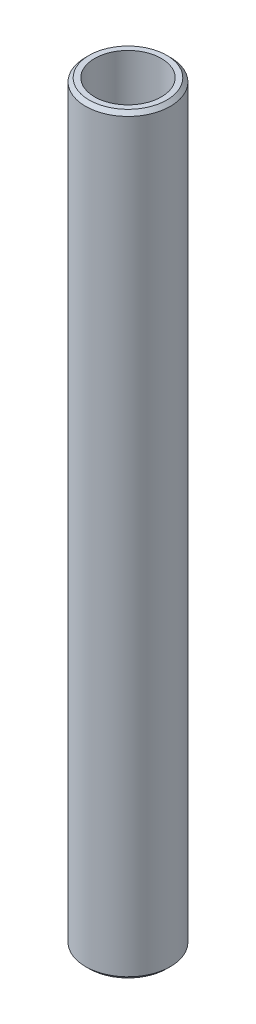
ISO-10303-21;
HEADER;
FILE_DESCRIPTION(('STEP AP214'),'2;1');
FILE_NAME('part.step','',(''),(''),'','','');
FILE_SCHEMA(('AUTOMOTIVE_DESIGN { 1 0 10303 214 1 1 1 1 }'));
ENDSEC;
DATA;
#1=APPLICATION_CONTEXT('core data for automotive mechanical design processes');
#2=APPLICATION_PROTOCOL_DEFINITION('international standard','automotive_design',2000,#1);
#3=PRODUCT_CONTEXT('',#1,'mechanical');
#4=PRODUCT('Part','Part','',(#3));
#5=PRODUCT_RELATED_PRODUCT_CATEGORY('part','',(#4));
#6=PRODUCT_DEFINITION_FORMATION('','',#4);
#7=PRODUCT_DEFINITION_CONTEXT('part definition',#1,'design');
#8=PRODUCT_DEFINITION('design','',#6,#7);
#9=PRODUCT_DEFINITION_SHAPE('','',#8);
#10=(LENGTH_UNIT() NAMED_UNIT(*) SI_UNIT(.MILLI.,.METRE.));
#11=(NAMED_UNIT(*) PLANE_ANGLE_UNIT() SI_UNIT($,.RADIAN.));
#12=(NAMED_UNIT(*) SI_UNIT($,.STERADIAN.) SOLID_ANGLE_UNIT());
#13=UNCERTAINTY_MEASURE_WITH_UNIT(LENGTH_MEASURE(1.E-05),#10,'distance_accuracy_value','');
#14=(GEOMETRIC_REPRESENTATION_CONTEXT(3) GLOBAL_UNCERTAINTY_ASSIGNED_CONTEXT((#13)) GLOBAL_UNIT_ASSIGNED_CONTEXT((#10,
#11,#12)) REPRESENTATION_CONTEXT('',''));
#15=CARTESIAN_POINT('',(0.,0.,0.));
#16=DIRECTION('',(0.,0.,1.));
#17=DIRECTION('',(1.,0.,0.));
#18=AXIS2_PLACEMENT_3D('',#15,#16,#17);
#19=CARTESIAN_POINT('',(0.,576.555281836907,0.));
#20=DIRECTION('',(0.,-1.,0.));
#21=DIRECTION('',(0.,0.,-1.));
#22=AXIS2_PLACEMENT_3D('',#19,#20,#21);
#23=CYLINDRICAL_SURFACE('',#22,32.5);
#24=CARTESIAN_POINT('',(0.,573.782739178935,0.));
#25=DIRECTION('',(0.,1.,0.));
#26=DIRECTION('',(0.,0.,1.));
#27=AXIS2_PLACEMENT_3D('',#24,#25,#26);
#28=CIRCLE('',#27,32.5);
#29=CARTESIAN_POINT('',(0.,573.782739178935,32.5));
#30=VERTEX_POINT('',#29);
#31=EDGE_CURVE('E50',#30,#30,#28,.F.);
#32=ORIENTED_EDGE('',*,*,#31,.T.);
#33=EDGE_LOOP('',(#32));
#34=FACE_BOUND('',#33,.T.);
#35=CARTESIAN_POINT('',(0.,2.77254265797278,0.));
#36=DIRECTION('',(0.,1.,0.));
#37=DIRECTION('',(0.,0.,1.));
#38=AXIS2_PLACEMENT_3D('',#35,#36,#37);
#39=CIRCLE('',#38,32.5);
#40=CARTESIAN_POINT('',(0.,2.77254265797278,32.5));
#41=VERTEX_POINT('',#40);
#42=EDGE_CURVE('E51',#41,#41,#39,.T.);
#43=ORIENTED_EDGE('',*,*,#42,.T.);
#44=EDGE_LOOP('',(#43));
#45=FACE_BOUND('',#44,.T.);
#46=ADVANCED_FACE('F39',(#34,#45),#23,.T.);
#47=CARTESIAN_POINT('',(0.,576.555281836907,0.));
#48=DIRECTION('',(0.,1.,0.));
#49=DIRECTION('',(0.,0.,1.));
#50=AXIS2_PLACEMENT_3D('',#47,#48,#49);
#51=PLANE('',#50);
#52=CARTESIAN_POINT('',(0.,576.555281836907,0.));
#53=DIRECTION('',(0.,1.,0.));
#54=DIRECTION('',(0.,0.,1.));
#55=AXIS2_PLACEMENT_3D('',#52,#53,#54);
#56=CIRCLE('',#55,29.7274573420274);
#57=CARTESIAN_POINT('',(0.,576.555281836907,29.7274573420274));
#58=VERTEX_POINT('',#57);
#59=EDGE_CURVE('E54',#58,#58,#56,.T.);
#60=ORIENTED_EDGE('',*,*,#59,.T.);
#61=EDGE_LOOP('',(#60));
#62=FACE_BOUND('',#61,.T.);
#63=CARTESIAN_POINT('',(0.,576.555281836907,0.));
#64=DIRECTION('',(0.,1.,0.));
#65=DIRECTION('',(0.,0.,1.));
#66=AXIS2_PLACEMENT_3D('',#63,#64,#65);
#67=CIRCLE('',#66,25.5768152113732);
#68=CARTESIAN_POINT('',(0.,576.555281836907,25.5768152113732));
#69=VERTEX_POINT('',#68);
#70=EDGE_CURVE('E58',#69,#69,#67,.T.);
#71=ORIENTED_EDGE('',*,*,#70,.F.);
#72=EDGE_LOOP('',(#71));
#73=FACE_BOUND('',#72,.T.);
#74=ADVANCED_FACE('F69',(#62,#73),#51,.T.);
#75=CARTESIAN_POINT('',(0.,0.,0.));
#76=DIRECTION('',(0.,1.,0.));
#77=DIRECTION('',(0.,0.,1.));
#78=AXIS2_PLACEMENT_3D('',#75,#76,#77);
#79=PLANE('',#78);
#80=CARTESIAN_POINT('',(0.,0.,0.));
#81=DIRECTION('',(0.,1.,0.));
#82=DIRECTION('',(0.,0.,1.));
#83=AXIS2_PLACEMENT_3D('',#80,#81,#82);
#84=CIRCLE('',#83,29.7274573420273);
#85=CARTESIAN_POINT('',(0.,0.,29.7274573420273));
#86=VERTEX_POINT('',#85);
#87=EDGE_CURVE('E10',#86,#86,#84,.F.);
#88=ORIENTED_EDGE('',*,*,#87,.T.);
#89=EDGE_LOOP('',(#88));
#90=FACE_BOUND('',#89,.T.);
#91=CARTESIAN_POINT('',(0.,0.,0.));
#92=DIRECTION('',(0.,1.,0.));
#93=DIRECTION('',(0.,0.,1.));
#94=AXIS2_PLACEMENT_3D('',#91,#92,#93);
#95=CIRCLE('',#94,25.5768152113732);
#96=CARTESIAN_POINT('',(0.,0.,25.5768152113732));
#97=VERTEX_POINT('',#96);
#98=EDGE_CURVE('E63',#97,#97,#95,.T.);
#99=ORIENTED_EDGE('',*,*,#98,.T.);
#100=EDGE_LOOP('',(#99));
#101=FACE_BOUND('',#100,.T.);
#102=ADVANCED_FACE('F75',(#90,#101),#79,.F.);
#103=CARTESIAN_POINT('',(0.,576.555281836907,0.));
#104=DIRECTION('',(0.,-1.,0.));
#105=DIRECTION('',(0.,0.,-1.));
#106=AXIS2_PLACEMENT_3D('',#103,#104,#105);
#107=CYLINDRICAL_SURFACE('',#106,25.5768152113732);
#108=ORIENTED_EDGE('',*,*,#70,.T.);
#109=EDGE_LOOP('',(#108));
#110=FACE_BOUND('',#109,.T.);
#111=ORIENTED_EDGE('',*,*,#98,.F.);
#112=EDGE_LOOP('',(#111));
#113=FACE_BOUND('',#112,.T.);
#114=ADVANCED_FACE('F70',(#110,#113),#107,.F.);
#115=CARTESIAN_POINT('',(0.,576.555281836907,0.));
#116=DIRECTION('',(0.,-1.,0.));
#117=DIRECTION('',(0.,0.,-1.));
#118=AXIS2_PLACEMENT_3D('',#115,#116,#117);
#119=CONICAL_SURFACE('',#118,29.7274573420274,0.785398163397443);
#120=ORIENTED_EDGE('',*,*,#31,.F.);
#121=EDGE_LOOP('',(#120));
#122=FACE_BOUND('',#121,.T.);
#123=ORIENTED_EDGE('',*,*,#59,.F.);
#124=EDGE_LOOP('',(#123));
#125=FACE_BOUND('',#124,.T.);
#126=ADVANCED_FACE('F81',(#122,#125),#119,.T.);
#127=CARTESIAN_POINT('',(0.,2.77254265797278,0.));
#128=DIRECTION('',(0.,1.,0.));
#129=DIRECTION('',(0.,0.,1.));
#130=AXIS2_PLACEMENT_3D('',#127,#128,#129);
#131=CONICAL_SURFACE('',#130,32.5,0.785398163397443);
#132=ORIENTED_EDGE('',*,*,#87,.F.);
#133=EDGE_LOOP('',(#132));
#134=FACE_BOUND('',#133,.T.);
#135=ORIENTED_EDGE('',*,*,#42,.F.);
#136=EDGE_LOOP('',(#135));
#137=FACE_BOUND('',#136,.T.);
#138=ADVANCED_FACE('F45',(#134,#137),#131,.T.);
#139=CLOSED_SHELL('',(#46,#74,#102,#114,#126,#138));
#140=MANIFOLD_SOLID_BREP('B2',#139);
#141=ADVANCED_BREP_SHAPE_REPRESENTATION('',(#18,#140),#14);
#142=SHAPE_DEFINITION_REPRESENTATION(#9,#141);
ENDSEC;
END-ISO-10303-21;
